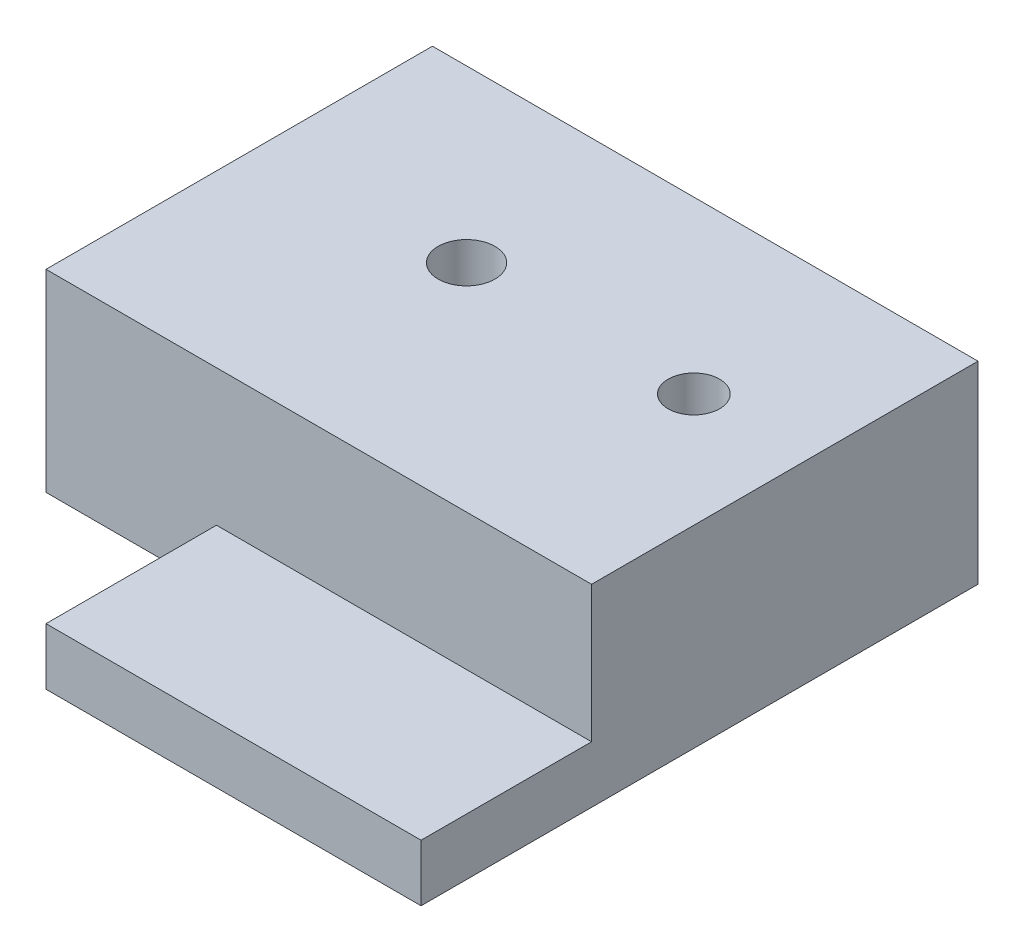
ISO-10303-21;
HEADER;
FILE_DESCRIPTION(('STEP AP214'),'2;1');
FILE_NAME('part.step','',(''),(''),'','','');
FILE_SCHEMA(('AUTOMOTIVE_DESIGN { 1 0 10303 214 1 1 1 1 }'));
ENDSEC;
DATA;
#1=APPLICATION_CONTEXT('core data for automotive mechanical design processes');
#2=APPLICATION_PROTOCOL_DEFINITION('international standard','automotive_design',2000,#1);
#3=PRODUCT_CONTEXT('',#1,'mechanical');
#4=PRODUCT('Part','Part','',(#3));
#5=PRODUCT_RELATED_PRODUCT_CATEGORY('part','',(#4));
#6=PRODUCT_DEFINITION_FORMATION('','',#4);
#7=PRODUCT_DEFINITION_CONTEXT('part definition',#1,'design');
#8=PRODUCT_DEFINITION('design','',#6,#7);
#9=PRODUCT_DEFINITION_SHAPE('','',#8);
#10=(LENGTH_UNIT() NAMED_UNIT(*) SI_UNIT(.MILLI.,.METRE.));
#11=(NAMED_UNIT(*) PLANE_ANGLE_UNIT() SI_UNIT($,.RADIAN.));
#12=(NAMED_UNIT(*) SI_UNIT($,.STERADIAN.) SOLID_ANGLE_UNIT());
#13=UNCERTAINTY_MEASURE_WITH_UNIT(LENGTH_MEASURE(1.E-05),#10,'distance_accuracy_value','');
#14=(GEOMETRIC_REPRESENTATION_CONTEXT(3) GLOBAL_UNCERTAINTY_ASSIGNED_CONTEXT((#13)) GLOBAL_UNIT_ASSIGNED_CONTEXT((#10,
#11,#12)) REPRESENTATION_CONTEXT('',''));
#15=CARTESIAN_POINT('',(0.,0.,0.));
#16=DIRECTION('',(0.,0.,1.));
#17=DIRECTION('',(1.,0.,0.));
#18=AXIS2_PLACEMENT_3D('',#15,#16,#17);
#19=CARTESIAN_POINT('',(0.,5.,0.));
#20=DIRECTION('',(0.,1.,0.));
#21=DIRECTION('',(0.,0.,1.));
#22=AXIS2_PLACEMENT_3D('',#19,#20,#21);
#23=PLANE('',#22);
#24=CARTESIAN_POINT('',(38.,5.,-34.));
#25=DIRECTION('',(0.,1.,0.));
#26=DIRECTION('',(0.,0.,1.));
#27=AXIS2_PLACEMENT_3D('',#24,#25,#26);
#28=CIRCLE('',#27,2.);
#29=CARTESIAN_POINT('',(38.,5.,-32.));
#30=VERTEX_POINT('',#29);
#31=EDGE_CURVE('E145',#30,#30,#28,.T.);
#32=ORIENTED_EDGE('',*,*,#31,.F.);
#33=EDGE_LOOP('',(#32));
#34=FACE_BOUND('',#33,.T.);
#35=CARTESIAN_POINT('',(38.,5.,-34.));
#36=DIRECTION('',(0.,1.,0.));
#37=DIRECTION('',(0.,0.,1.));
#38=AXIS2_PLACEMENT_3D('',#35,#36,#37);
#39=CIRCLE('',#38,2.26470283825256);
#40=CARTESIAN_POINT('',(38.,5.,-31.7352971617474));
#41=VERTEX_POINT('',#40);
#42=EDGE_CURVE('E306',#41,#41,#39,.T.);
#43=ORIENTED_EDGE('',*,*,#42,.T.);
#44=EDGE_LOOP('',(#43));
#45=FACE_BOUND('',#44,.T.);
#46=ADVANCED_FACE('F39',(#34,#45),#23,.T.);
#47=CARTESIAN_POINT('',(15.,5.,0.));
#48=DIRECTION('',(-1.,0.,0.));
#49=DIRECTION('',(0.,0.,1.));
#50=AXIS2_PLACEMENT_3D('',#47,#48,#49);
#51=PLANE('',#50);
#52=DIRECTION('',(0.,0.,-1.));
#53=VECTOR('',#52,1.);
#54=CARTESIAN_POINT('',(15.,0.,0.));
#55=LINE('',#54,#53);
#56=CARTESIAN_POINT('',(15.,0.,0.));
#57=VERTEX_POINT('',#56);
#58=CARTESIAN_POINT('',(15.,0.,-15.));
#59=VERTEX_POINT('',#58);
#60=EDGE_CURVE('E167',#57,#59,#55,.T.);
#61=ORIENTED_EDGE('',*,*,#60,.F.);
#62=DIRECTION('',(0.,-1.,0.));
#63=VECTOR('',#62,1.);
#64=CARTESIAN_POINT('',(15.,5.,0.));
#65=LINE('',#64,#63);
#66=CARTESIAN_POINT('',(15.,5.,0.));
#67=VERTEX_POINT('',#66);
#68=EDGE_CURVE('E43',#67,#57,#65,.T.);
#69=ORIENTED_EDGE('',*,*,#68,.F.);
#70=DIRECTION('',(0.,0.,-1.));
#71=VECTOR('',#70,1.);
#72=CARTESIAN_POINT('',(15.,5.,0.));
#73=LINE('',#72,#71);
#74=CARTESIAN_POINT('',(15.,5.,-15.));
#75=VERTEX_POINT('',#74);
#76=EDGE_CURVE('E149',#67,#75,#73,.T.);
#77=ORIENTED_EDGE('',*,*,#76,.T.);
#78=DIRECTION('',(0.,-1.,0.));
#79=VECTOR('',#78,1.);
#80=CARTESIAN_POINT('',(15.,5.,-15.));
#81=LINE('',#80,#79);
#82=EDGE_CURVE('E87',#75,#59,#81,.T.);
#83=ORIENTED_EDGE('',*,*,#82,.T.);
#84=EDGE_LOOP('',(#61,#69,#77,#83));
#85=FACE_BOUND('',#84,.T.);
#86=ADVANCED_FACE('F204',(#85),#51,.T.);
#87=CARTESIAN_POINT('',(0.,5.,0.));
#88=DIRECTION('',(0.,0.,-1.));
#89=DIRECTION('',(-1.,0.,0.));
#90=AXIS2_PLACEMENT_3D('',#87,#88,#89);
#91=PLANE('',#90);
#92=DIRECTION('',(1.,0.,0.));
#93=VECTOR('',#92,1.);
#94=CARTESIAN_POINT('',(0.,0.,0.));
#95=LINE('',#94,#93);
#96=CARTESIAN_POINT('',(48.,0.,0.));
#97=VERTEX_POINT('',#96);
#98=EDGE_CURVE('E171',#57,#97,#95,.T.);
#99=ORIENTED_EDGE('',*,*,#98,.T.);
#100=DIRECTION('',(0.,-1.,0.));
#101=VECTOR('',#100,1.);
#102=CARTESIAN_POINT('',(48.,5.,0.));
#103=LINE('',#102,#101);
#104=CARTESIAN_POINT('',(48.,5.,0.));
#105=VERTEX_POINT('',#104);
#106=EDGE_CURVE('E193',#105,#97,#103,.T.);
#107=ORIENTED_EDGE('',*,*,#106,.F.);
#108=DIRECTION('',(1.,0.,0.));
#109=VECTOR('',#108,1.);
#110=CARTESIAN_POINT('',(0.,5.,0.));
#111=LINE('',#110,#109);
#112=EDGE_CURVE('E153',#67,#105,#111,.T.);
#113=ORIENTED_EDGE('',*,*,#112,.F.);
#114=ORIENTED_EDGE('',*,*,#68,.T.);
#115=EDGE_LOOP('',(#99,#107,#113,#114));
#116=FACE_BOUND('',#115,.T.);
#117=ADVANCED_FACE('F201',(#116),#91,.F.);
#118=CARTESIAN_POINT('',(48.,5.,0.));
#119=DIRECTION('',(-1.,0.,0.));
#120=DIRECTION('',(0.,0.,1.));
#121=AXIS2_PLACEMENT_3D('',#118,#119,#120);
#122=PLANE('',#121);
#123=DIRECTION('',(0.,0.,-1.));
#124=VECTOR('',#123,1.);
#125=CARTESIAN_POINT('',(48.,0.,0.));
#126=LINE('',#125,#124);
#127=CARTESIAN_POINT('',(48.,0.,-49.));
#128=VERTEX_POINT('',#127);
#129=EDGE_CURVE('E175',#97,#128,#126,.T.);
#130=ORIENTED_EDGE('',*,*,#129,.T.);
#131=DIRECTION('',(0.,-1.,0.));
#132=VECTOR('',#131,1.);
#133=CARTESIAN_POINT('',(48.,5.,-49.));
#134=LINE('',#133,#132);
#135=CARTESIAN_POINT('',(48.,17.,-49.));
#136=VERTEX_POINT('',#135);
#137=EDGE_CURVE('E191',#136,#128,#134,.T.);
#138=ORIENTED_EDGE('',*,*,#137,.F.);
#139=DIRECTION('',(0.,0.,-1.));
#140=VECTOR('',#139,1.);
#141=CARTESIAN_POINT('',(48.,17.,-49.));
#142=LINE('',#141,#140);
#143=CARTESIAN_POINT('',(48.,17.,-15.));
#144=VERTEX_POINT('',#143);
#145=EDGE_CURVE('E122',#144,#136,#142,.T.);
#146=ORIENTED_EDGE('',*,*,#145,.F.);
#147=DIRECTION('',(0.,-1.,0.));
#148=VECTOR('',#147,1.);
#149=CARTESIAN_POINT('',(48.,17.,-15.));
#150=LINE('',#149,#148);
#151=CARTESIAN_POINT('',(48.,5.,-15.));
#152=VERTEX_POINT('',#151);
#153=EDGE_CURVE('E117',#144,#152,#150,.T.);
#154=ORIENTED_EDGE('',*,*,#153,.T.);
#155=DIRECTION('',(0.,0.,-1.));
#156=VECTOR('',#155,1.);
#157=CARTESIAN_POINT('',(48.,5.,0.));
#158=LINE('',#157,#156);
#159=EDGE_CURVE('E157',#105,#152,#158,.T.);
#160=ORIENTED_EDGE('',*,*,#159,.F.);
#161=ORIENTED_EDGE('',*,*,#106,.T.);
#162=EDGE_LOOP('',(#130,#138,#146,#154,#160,#161));
#163=FACE_BOUND('',#162,.T.);
#164=ADVANCED_FACE('F211',(#163),#122,.F.);
#165=CARTESIAN_POINT('',(0.,5.,-49.));
#166=DIRECTION('',(0.,0.,-1.));
#167=DIRECTION('',(-1.,0.,0.));
#168=AXIS2_PLACEMENT_3D('',#165,#166,#167);
#169=PLANE('',#168);
#170=DIRECTION('',(1.,0.,0.));
#171=VECTOR('',#170,1.);
#172=CARTESIAN_POINT('',(0.,0.,-49.));
#173=LINE('',#172,#171);
#174=CARTESIAN_POINT('',(0.,0.,-49.));
#175=VERTEX_POINT('',#174);
#176=EDGE_CURVE('E179',#175,#128,#173,.T.);
#177=ORIENTED_EDGE('',*,*,#176,.F.);
#178=DIRECTION('',(0.,-1.,0.));
#179=VECTOR('',#178,1.);
#180=CARTESIAN_POINT('',(0.,5.,-49.));
#181=LINE('',#180,#179);
#182=CARTESIAN_POINT('',(0.,17.,-49.));
#183=VERTEX_POINT('',#182);
#184=EDGE_CURVE('E111',#183,#175,#181,.T.);
#185=ORIENTED_EDGE('',*,*,#184,.F.);
#186=DIRECTION('',(-1.,0.,0.));
#187=VECTOR('',#186,1.);
#188=CARTESIAN_POINT('',(0.,17.,-49.));
#189=LINE('',#188,#187);
#190=EDGE_CURVE('E128',#136,#183,#189,.T.);
#191=ORIENTED_EDGE('',*,*,#190,.F.);
#192=ORIENTED_EDGE('',*,*,#137,.T.);
#193=EDGE_LOOP('',(#177,#185,#191,#192));
#194=FACE_BOUND('',#193,.T.);
#195=ADVANCED_FACE('F225',(#194),#169,.T.);
#196=CARTESIAN_POINT('',(0.,5.,0.));
#197=DIRECTION('',(-1.,0.,0.));
#198=DIRECTION('',(0.,0.,1.));
#199=AXIS2_PLACEMENT_3D('',#196,#197,#198);
#200=PLANE('',#199);
#201=DIRECTION('',(0.,0.,-1.));
#202=VECTOR('',#201,1.);
#203=CARTESIAN_POINT('',(0.,0.,0.));
#204=LINE('',#203,#202);
#205=CARTESIAN_POINT('',(0.,0.,-15.));
#206=VERTEX_POINT('',#205);
#207=EDGE_CURVE('E109',#206,#175,#204,.T.);
#208=ORIENTED_EDGE('',*,*,#207,.F.);
#209=DIRECTION('',(0.,-1.,0.));
#210=VECTOR('',#209,1.);
#211=CARTESIAN_POINT('',(0.,5.,-15.));
#212=LINE('',#211,#210);
#213=CARTESIAN_POINT('',(0.,17.,-15.));
#214=VERTEX_POINT('',#213);
#215=EDGE_CURVE('E81',#214,#206,#212,.T.);
#216=ORIENTED_EDGE('',*,*,#215,.F.);
#217=DIRECTION('',(0.,0.,1.));
#218=VECTOR('',#217,1.);
#219=CARTESIAN_POINT('',(0.,17.,-49.));
#220=LINE('',#219,#218);
#221=EDGE_CURVE('E107',#183,#214,#220,.T.);
#222=ORIENTED_EDGE('',*,*,#221,.F.);
#223=ORIENTED_EDGE('',*,*,#184,.T.);
#224=EDGE_LOOP('',(#208,#216,#222,#223));
#225=FACE_BOUND('',#224,.T.);
#226=ADVANCED_FACE('F105',(#225),#200,.T.);
#227=CARTESIAN_POINT('',(38.,5.,-34.));
#228=DIRECTION('',(0.,-1.,0.));
#229=DIRECTION('',(0.,0.,-1.));
#230=AXIS2_PLACEMENT_3D('',#227,#228,#229);
#231=CYLINDRICAL_SURFACE('',#230,2.);
#232=ORIENTED_EDGE('',*,*,#31,.T.);
#233=EDGE_LOOP('',(#232));
#234=FACE_BOUND('',#233,.T.);
#235=CARTESIAN_POINT('',(38.,0.,-34.));
#236=DIRECTION('',(0.,1.,0.));
#237=DIRECTION('',(0.,0.,1.));
#238=AXIS2_PLACEMENT_3D('',#235,#236,#237);
#239=CIRCLE('',#238,2.);
#240=CARTESIAN_POINT('',(38.,0.,-32.));
#241=VERTEX_POINT('',#240);
#242=EDGE_CURVE('E163',#241,#241,#239,.T.);
#243=ORIENTED_EDGE('',*,*,#242,.F.);
#244=EDGE_LOOP('',(#243));
#245=FACE_BOUND('',#244,.T.);
#246=ADVANCED_FACE('F217',(#234,#245),#231,.F.);
#247=CARTESIAN_POINT('',(18.,5.,-34.));
#248=DIRECTION('',(0.,-1.,0.));
#249=DIRECTION('',(0.,0.,-1.));
#250=AXIS2_PLACEMENT_3D('',#247,#248,#249);
#251=CYLINDRICAL_SURFACE('',#250,2.5);
#252=CARTESIAN_POINT('',(18.,0.,-34.));
#253=DIRECTION('',(0.,1.,0.));
#254=DIRECTION('',(0.,0.,1.));
#255=AXIS2_PLACEMENT_3D('',#252,#253,#254);
#256=CIRCLE('',#255,2.5);
#257=CARTESIAN_POINT('',(18.,0.,-31.5));
#258=VERTEX_POINT('',#257);
#259=EDGE_CURVE('E144',#258,#258,#256,.T.);
#260=ORIENTED_EDGE('',*,*,#259,.F.);
#261=EDGE_LOOP('',(#260));
#262=FACE_BOUND('',#261,.T.);
#263=CARTESIAN_POINT('',(18.,17.,-34.));
#264=DIRECTION('',(0.,1.,0.));
#265=DIRECTION('',(0.,0.,1.));
#266=AXIS2_PLACEMENT_3D('',#263,#264,#265);
#267=CIRCLE('',#266,2.5);
#268=CARTESIAN_POINT('',(18.,17.,-31.5));
#269=VERTEX_POINT('',#268);
#270=EDGE_CURVE('E130',#269,#269,#267,.T.);
#271=ORIENTED_EDGE('',*,*,#270,.T.);
#272=EDGE_LOOP('',(#271));
#273=FACE_BOUND('',#272,.T.);
#274=ADVANCED_FACE('F41',(#262,#273),#251,.F.);
#275=CARTESIAN_POINT('',(0.,5.,-15.));
#276=DIRECTION('',(0.,0.,-1.));
#277=DIRECTION('',(-1.,0.,0.));
#278=AXIS2_PLACEMENT_3D('',#275,#276,#277);
#279=PLANE('',#278);
#280=DIRECTION('',(1.,0.,0.));
#281=VECTOR('',#280,1.);
#282=CARTESIAN_POINT('',(0.,0.,-15.));
#283=LINE('',#282,#281);
#284=EDGE_CURVE('E150',#206,#59,#283,.T.);
#285=ORIENTED_EDGE('',*,*,#284,.T.);
#286=ORIENTED_EDGE('',*,*,#82,.F.);
#287=DIRECTION('',(1.,0.,0.));
#288=VECTOR('',#287,1.);
#289=CARTESIAN_POINT('',(0.,5.,-15.));
#290=LINE('',#289,#288);
#291=EDGE_CURVE('E11',#75,#152,#290,.T.);
#292=ORIENTED_EDGE('',*,*,#291,.T.);
#293=ORIENTED_EDGE('',*,*,#153,.F.);
#294=DIRECTION('',(1.,0.,0.));
#295=VECTOR('',#294,1.);
#296=CARTESIAN_POINT('',(0.,17.,-15.));
#297=LINE('',#296,#295);
#298=EDGE_CURVE('E114',#214,#144,#297,.T.);
#299=ORIENTED_EDGE('',*,*,#298,.F.);
#300=ORIENTED_EDGE('',*,*,#215,.T.);
#301=EDGE_LOOP('',(#285,#286,#292,#293,#299,#300));
#302=FACE_BOUND('',#301,.T.);
#303=ADVANCED_FACE('F115',(#302),#279,.F.);
#304=ORIENTED_EDGE('',*,*,#291,.F.);
#305=ORIENTED_EDGE('',*,*,#76,.F.);
#306=ORIENTED_EDGE('',*,*,#112,.T.);
#307=ORIENTED_EDGE('',*,*,#159,.T.);
#308=EDGE_LOOP('',(#304,#305,#306,#307));
#309=FACE_BOUND('',#308,.T.);
#310=ADVANCED_FACE('F215',(#309),#23,.T.);
#311=CARTESIAN_POINT('',(0.,0.,0.));
#312=DIRECTION('',(0.,1.,0.));
#313=DIRECTION('',(0.,0.,1.));
#314=AXIS2_PLACEMENT_3D('',#311,#312,#313);
#315=PLANE('',#314);
#316=ORIENTED_EDGE('',*,*,#259,.T.);
#317=EDGE_LOOP('',(#316));
#318=FACE_BOUND('',#317,.T.);
#319=ORIENTED_EDGE('',*,*,#242,.T.);
#320=EDGE_LOOP('',(#319));
#321=FACE_BOUND('',#320,.T.);
#322=ORIENTED_EDGE('',*,*,#60,.T.);
#323=ORIENTED_EDGE('',*,*,#284,.F.);
#324=ORIENTED_EDGE('',*,*,#207,.T.);
#325=ORIENTED_EDGE('',*,*,#176,.T.);
#326=ORIENTED_EDGE('',*,*,#129,.F.);
#327=ORIENTED_EDGE('',*,*,#98,.F.);
#328=EDGE_LOOP('',(#322,#323,#324,#325,#326,#327));
#329=FACE_BOUND('',#328,.T.);
#330=ADVANCED_FACE('F203',(#318,#321,#329),#315,.F.);
#331=CARTESIAN_POINT('',(0.,17.,0.));
#332=DIRECTION('',(0.,1.,0.));
#333=DIRECTION('',(0.,0.,1.));
#334=AXIS2_PLACEMENT_3D('',#331,#332,#333);
#335=PLANE('',#334);
#336=ORIENTED_EDGE('',*,*,#270,.F.);
#337=EDGE_LOOP('',(#336));
#338=FACE_BOUND('',#337,.T.);
#339=ORIENTED_EDGE('',*,*,#221,.T.);
#340=ORIENTED_EDGE('',*,*,#298,.T.);
#341=ORIENTED_EDGE('',*,*,#145,.T.);
#342=ORIENTED_EDGE('',*,*,#190,.T.);
#343=EDGE_LOOP('',(#339,#340,#341,#342));
#344=FACE_BOUND('',#343,.T.);
#345=CARTESIAN_POINT('',(38.,17.,-34.));
#346=DIRECTION('',(0.,1.,0.));
#347=DIRECTION('',(0.,0.,1.));
#348=AXIS2_PLACEMENT_3D('',#345,#346,#347);
#349=CIRCLE('',#348,2.26470283825256);
#350=CARTESIAN_POINT('',(38.,17.,-31.7352971617474));
#351=VERTEX_POINT('',#350);
#352=EDGE_CURVE('E134',#351,#351,#349,.T.);
#353=ORIENTED_EDGE('',*,*,#352,.F.);
#354=EDGE_LOOP('',(#353));
#355=FACE_BOUND('',#354,.T.);
#356=ADVANCED_FACE('F125',(#338,#344,#355),#335,.T.);
#357=CARTESIAN_POINT('',(38.,17.,-34.));
#358=DIRECTION('',(0.,-1.,0.));
#359=DIRECTION('',(0.,0.,-1.));
#360=AXIS2_PLACEMENT_3D('',#357,#358,#359);
#361=CYLINDRICAL_SURFACE('',#360,2.26470283825256);
#362=ORIENTED_EDGE('',*,*,#352,.T.);
#363=EDGE_LOOP('',(#362));
#364=FACE_BOUND('',#363,.T.);
#365=ORIENTED_EDGE('',*,*,#42,.F.);
#366=EDGE_LOOP('',(#365));
#367=FACE_BOUND('',#366,.T.);
#368=ADVANCED_FACE('F238',(#364,#367),#361,.F.);
#369=CLOSED_SHELL('',(#46,#86,#117,#164,#195,#226,#246,#274,#303,#310,#330,#356,#368));
#370=MANIFOLD_SOLID_BREP('B2',#369);
#371=ADVANCED_BREP_SHAPE_REPRESENTATION('',(#18,#370),#14);
#372=SHAPE_DEFINITION_REPRESENTATION(#9,#371);
ENDSEC;
END-ISO-10303-21;
